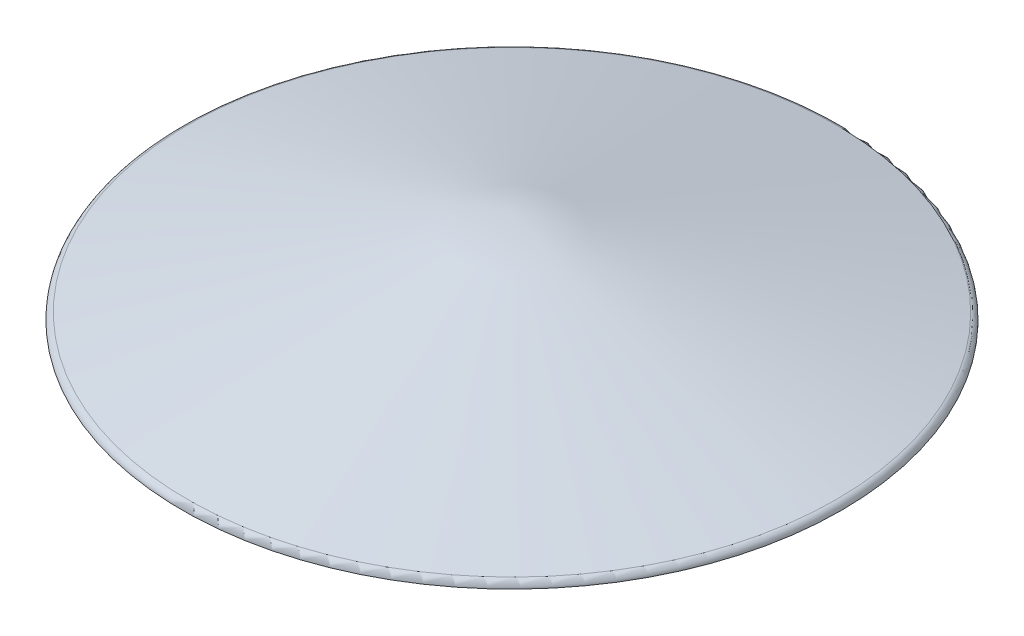
ISO-10303-21;
HEADER;
FILE_DESCRIPTION(('STEP AP214'),'2;1');
FILE_NAME('part.step','',(''),(''),'','','');
FILE_SCHEMA(('AUTOMOTIVE_DESIGN { 1 0 10303 214 1 1 1 1 }'));
ENDSEC;
DATA;
#1=APPLICATION_CONTEXT('core data for automotive mechanical design processes');
#2=APPLICATION_PROTOCOL_DEFINITION('international standard','automotive_design',2000,#1);
#3=PRODUCT_CONTEXT('',#1,'mechanical');
#4=PRODUCT('Part','Part','',(#3));
#5=PRODUCT_RELATED_PRODUCT_CATEGORY('part','',(#4));
#6=PRODUCT_DEFINITION_FORMATION('','',#4);
#7=PRODUCT_DEFINITION_CONTEXT('part definition',#1,'design');
#8=PRODUCT_DEFINITION('design','',#6,#7);
#9=PRODUCT_DEFINITION_SHAPE('','',#8);
#10=(LENGTH_UNIT() NAMED_UNIT(*) SI_UNIT(.MILLI.,.METRE.));
#11=(NAMED_UNIT(*) PLANE_ANGLE_UNIT() SI_UNIT($,.RADIAN.));
#12=(NAMED_UNIT(*) SI_UNIT($,.STERADIAN.) SOLID_ANGLE_UNIT());
#13=UNCERTAINTY_MEASURE_WITH_UNIT(LENGTH_MEASURE(1.E-05),#10,'distance_accuracy_value','');
#14=(GEOMETRIC_REPRESENTATION_CONTEXT(3) GLOBAL_UNCERTAINTY_ASSIGNED_CONTEXT((#13)) GLOBAL_UNIT_ASSIGNED_CONTEXT((#10,
#11,#12)) REPRESENTATION_CONTEXT('',''));
#15=CARTESIAN_POINT('',(0.,0.,0.));
#16=DIRECTION('',(0.,0.,1.));
#17=DIRECTION('',(1.,0.,0.));
#18=AXIS2_PLACEMENT_3D('',#15,#16,#17);
#19=CARTESIAN_POINT('',(2.12315506977676E-11,28.9777747887511,0.));
#20=DIRECTION('',(0.,-1.,0.));
#21=DIRECTION('',(1.,0.,0.));
#22=AXIS2_PLACEMENT_3D('',#19,#20,#21);
#23=CONICAL_SURFACE('',#22,1477.7645713531,1.3089969389958);
#24=CARTESIAN_POINT('',(0.,424.943598286054,0.));
#25=VERTEX_POINT('',#24);
#26=VERTEX_LOOP('',#25);
#27=FACE_BOUND('',#26,.T.);
#28=CARTESIAN_POINT('',(2.12315506977676E-11,28.9777747887511,0.));
#29=DIRECTION('',(0.,-1.,0.));
#30=DIRECTION('',(1.,0.,0.));
#31=AXIS2_PLACEMENT_3D('',#28,#29,#30);
#32=CIRCLE('',#31,1477.7645713531);
#33=CARTESIAN_POINT('',(1477.76457135312,28.9777747888304,0.));
#34=VERTEX_POINT('',#33);
#35=EDGE_CURVE('E11',#34,#34,#32,.T.);
#36=ORIENTED_EDGE('',*,*,#35,.T.);
#37=EDGE_LOOP('',(#36));
#38=FACE_BOUND('',#37,.T.);
#39=ADVANCED_FACE('F33',(#27,#38),#23,.F.);
#40=CARTESIAN_POINT('',(2.28705943072782E-11,7.88258347483861E-11,0.));
#41=DIRECTION('',(0.,-1.,0.));
#42=DIRECTION('',(1.,0.,0.));
#43=AXIS2_PLACEMENT_3D('',#40,#41,#42);
#44=TOROIDAL_SURFACE('',#43,1470.00000000002,29.9999999999998);
#45=ORIENTED_EDGE('',*,*,#35,.F.);
#46=EDGE_LOOP('',(#45));
#47=FACE_BOUND('',#46,.T.);
#48=CARTESIAN_POINT('',(2.27853289736302E-11,8.04356581340926E-11,0.));
#49=DIRECTION('',(0.,-1.,0.));
#50=DIRECTION('',(1.,0.,0.));
#51=AXIS2_PLACEMENT_3D('',#48,#49,#50);
#52=CIRCLE('',#51,1500.00000000002);
#53=CARTESIAN_POINT('',(1500.00000000005,1.60865140066057E-10,0.));
#54=VERTEX_POINT('',#53);
#55=EDGE_CURVE('E40',#54,#54,#52,.T.);
#56=ORIENTED_EDGE('',*,*,#55,.T.);
#57=EDGE_LOOP('',(#56));
#58=FACE_BOUND('',#57,.T.);
#59=ADVANCED_FACE('F59',(#47,#58),#44,.F.);
#60=CARTESIAN_POINT('',(-1502.,0.,0.));
#61=DIRECTION('',(0.,1.,0.));
#62=DIRECTION('',(-1.,0.,0.));
#63=AXIS2_PLACEMENT_3D('',#60,#61,#62);
#64=PLANE('',#63);
#65=ORIENTED_EDGE('',*,*,#55,.F.);
#66=EDGE_LOOP('',(#65));
#67=FACE_BOUND('',#66,.T.);
#68=CARTESIAN_POINT('',(2.27853289736302E-11,8.05466804365551E-11,0.));
#69=DIRECTION('',(0.,-1.,0.));
#70=DIRECTION('',(1.,0.,0.));
#71=AXIS2_PLACEMENT_3D('',#68,#69,#70);
#72=CIRCLE('',#71,1502.00000000002);
#73=CARTESIAN_POINT('',(1502.00000000005,1.61083401677762E-10,0.));
#74=VERTEX_POINT('',#73);
#75=EDGE_CURVE('E70',#74,#74,#72,.T.);
#76=ORIENTED_EDGE('',*,*,#75,.T.);
#77=EDGE_LOOP('',(#76));
#78=FACE_BOUND('',#77,.T.);
#79=ADVANCED_FACE('F54',(#67,#78),#64,.F.);
#80=CARTESIAN_POINT('',(2.28705943072782E-11,7.88258347483861E-11,0.));
#81=DIRECTION('',(0.,-1.,0.));
#82=DIRECTION('',(1.,0.,0.));
#83=AXIS2_PLACEMENT_3D('',#80,#81,#82);
#84=TOROIDAL_SURFACE('',#83,1470.00000000002,31.9999999999998);
#85=ORIENTED_EDGE('',*,*,#75,.F.);
#86=EDGE_LOOP('',(#85));
#87=FACE_BOUND('',#86,.T.);
#88=CARTESIAN_POINT('',(2.11279654793767E-11,30.9096264413293,0.));
#89=DIRECTION('',(0.,-1.,0.));
#90=DIRECTION('',(1.,0.,0.));
#91=AXIS2_PLACEMENT_3D('',#88,#89,#90);
#92=CIRCLE('',#91,1478.2822094433);
#93=CARTESIAN_POINT('',(1478.28220944332,30.9096264414086,0.));
#94=VERTEX_POINT('',#93);
#95=EDGE_CURVE('E72',#94,#94,#92,.T.);
#96=ORIENTED_EDGE('',*,*,#95,.T.);
#97=EDGE_LOOP('',(#96));
#98=FACE_BOUND('',#97,.T.);
#99=ADVANCED_FACE('F48',(#87,#98),#84,.T.);
#100=CARTESIAN_POINT('',(-1.11022302462516E-13,427.014150646874,0.));
#101=DIRECTION('',(0.,-1.,0.));
#102=DIRECTION('',(1.,0.,0.));
#103=AXIS2_PLACEMENT_3D('',#100,#101,#102);
#104=CONICAL_SURFACE('',#103,0.,1.3089969389958);
#105=ORIENTED_EDGE('',*,*,#95,.F.);
#106=EDGE_LOOP('',(#105));
#107=FACE_BOUND('',#106,.T.);
#108=CARTESIAN_POINT('',(-1.11022302462516E-13,427.014150646874,0.));
#109=VERTEX_POINT('',#108);
#110=VERTEX_LOOP('',#109);
#111=FACE_BOUND('',#110,.T.);
#112=ADVANCED_FACE('F46',(#107,#111),#104,.T.);
#113=CLOSED_SHELL('',(#39,#59,#79,#99,#112));
#114=MANIFOLD_SOLID_BREP('B2',#113);
#115=ADVANCED_BREP_SHAPE_REPRESENTATION('',(#18,#114),#14);
#116=SHAPE_DEFINITION_REPRESENTATION(#9,#115);
ENDSEC;
END-ISO-10303-21;
